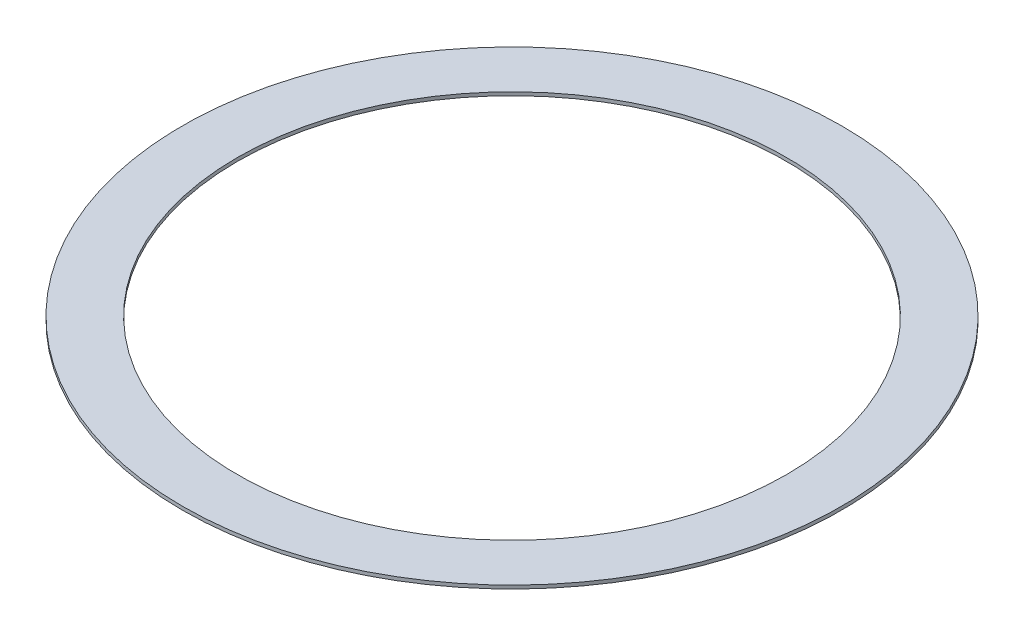
ISO-10303-21;
HEADER;
FILE_DESCRIPTION(('STEP AP214'),'2;1');
FILE_NAME('part.step','',(''),(''),'','','');
FILE_SCHEMA(('AUTOMOTIVE_DESIGN { 1 0 10303 214 1 1 1 1 }'));
ENDSEC;
DATA;
#1=APPLICATION_CONTEXT('core data for automotive mechanical design processes');
#2=APPLICATION_PROTOCOL_DEFINITION('international standard','automotive_design',2000,#1);
#3=PRODUCT_CONTEXT('',#1,'mechanical');
#4=PRODUCT('Part','Part','',(#3));
#5=PRODUCT_RELATED_PRODUCT_CATEGORY('part','',(#4));
#6=PRODUCT_DEFINITION_FORMATION('','',#4);
#7=PRODUCT_DEFINITION_CONTEXT('part definition',#1,'design');
#8=PRODUCT_DEFINITION('design','',#6,#7);
#9=PRODUCT_DEFINITION_SHAPE('','',#8);
#10=(LENGTH_UNIT() NAMED_UNIT(*) SI_UNIT(.MILLI.,.METRE.));
#11=(NAMED_UNIT(*) PLANE_ANGLE_UNIT() SI_UNIT($,.RADIAN.));
#12=(NAMED_UNIT(*) SI_UNIT($,.STERADIAN.) SOLID_ANGLE_UNIT());
#13=UNCERTAINTY_MEASURE_WITH_UNIT(LENGTH_MEASURE(1.E-05),#10,'distance_accuracy_value','');
#14=(GEOMETRIC_REPRESENTATION_CONTEXT(3) GLOBAL_UNCERTAINTY_ASSIGNED_CONTEXT((#13)) GLOBAL_UNIT_ASSIGNED_CONTEXT((#10,
#11,#12)) REPRESENTATION_CONTEXT('',''));
#15=CARTESIAN_POINT('',(0.,0.,0.));
#16=DIRECTION('',(0.,0.,1.));
#17=DIRECTION('',(1.,0.,0.));
#18=AXIS2_PLACEMENT_3D('',#15,#16,#17);
#19=CARTESIAN_POINT('',(0.,0.5,0.));
#20=DIRECTION('',(0.,1.,0.));
#21=DIRECTION('',(0.,0.,1.));
#22=AXIS2_PLACEMENT_3D('',#19,#20,#21);
#23=PLANE('',#22);
#24=CARTESIAN_POINT('',(0.,0.5,0.));
#25=DIRECTION('',(0.,1.,0.));
#26=DIRECTION('',(0.,0.,1.));
#27=AXIS2_PLACEMENT_3D('',#24,#25,#26);
#28=CIRCLE('',#27,48.);
#29=CARTESIAN_POINT('',(0.,0.5,48.));
#30=VERTEX_POINT('',#29);
#31=EDGE_CURVE('E11',#30,#30,#28,.T.);
#32=ORIENTED_EDGE('',*,*,#31,.T.);
#33=EDGE_LOOP('',(#32));
#34=FACE_BOUND('',#33,.T.);
#35=CARTESIAN_POINT('',(0.,0.5,0.));
#36=DIRECTION('',(0.,1.,0.));
#37=DIRECTION('',(1.,0.,0.));
#38=AXIS2_PLACEMENT_3D('',#35,#36,#37);
#39=CIRCLE('',#38,40.);
#40=CARTESIAN_POINT('',(40.,0.5,0.));
#41=VERTEX_POINT('',#40);
#42=EDGE_CURVE('E49',#41,#41,#39,.T.);
#43=ORIENTED_EDGE('',*,*,#42,.F.);
#44=EDGE_LOOP('',(#43));
#45=FACE_BOUND('',#44,.T.);
#46=ADVANCED_FACE('F38',(#34,#45),#23,.T.);
#47=CARTESIAN_POINT('',(0.,0.,0.));
#48=DIRECTION('',(0.,1.,0.));
#49=DIRECTION('',(0.,0.,1.));
#50=AXIS2_PLACEMENT_3D('',#47,#48,#49);
#51=PLANE('',#50);
#52=CARTESIAN_POINT('',(0.,0.,0.));
#53=DIRECTION('',(0.,1.,0.));
#54=DIRECTION('',(0.,0.,1.));
#55=AXIS2_PLACEMENT_3D('',#52,#53,#54);
#56=CIRCLE('',#55,48.);
#57=CARTESIAN_POINT('',(0.,0.,48.));
#58=VERTEX_POINT('',#57);
#59=EDGE_CURVE('E42',#58,#58,#56,.T.);
#60=ORIENTED_EDGE('',*,*,#59,.F.);
#61=EDGE_LOOP('',(#60));
#62=FACE_BOUND('',#61,.T.);
#63=CARTESIAN_POINT('',(0.,0.,0.));
#64=DIRECTION('',(0.,1.,0.));
#65=DIRECTION('',(1.,0.,0.));
#66=AXIS2_PLACEMENT_3D('',#63,#64,#65);
#67=CIRCLE('',#66,40.);
#68=CARTESIAN_POINT('',(40.,0.,0.));
#69=VERTEX_POINT('',#68);
#70=EDGE_CURVE('E51',#69,#69,#67,.T.);
#71=ORIENTED_EDGE('',*,*,#70,.T.);
#72=EDGE_LOOP('',(#71));
#73=FACE_BOUND('',#72,.T.);
#74=ADVANCED_FACE('F61',(#62,#73),#51,.F.);
#75=CARTESIAN_POINT('',(0.,0.5,0.));
#76=DIRECTION('',(0.,-1.,0.));
#77=DIRECTION('',(0.,0.,-1.));
#78=AXIS2_PLACEMENT_3D('',#75,#76,#77);
#79=CYLINDRICAL_SURFACE('',#78,48.);
#80=ORIENTED_EDGE('',*,*,#31,.F.);
#81=EDGE_LOOP('',(#80));
#82=FACE_BOUND('',#81,.T.);
#83=ORIENTED_EDGE('',*,*,#59,.T.);
#84=EDGE_LOOP('',(#83));
#85=FACE_BOUND('',#84,.T.);
#86=ADVANCED_FACE('F40',(#82,#85),#79,.T.);
#87=CARTESIAN_POINT('',(0.,0.5,0.));
#88=DIRECTION('',(0.,-1.,0.));
#89=DIRECTION('',(0.,0.,-1.));
#90=AXIS2_PLACEMENT_3D('',#87,#88,#89);
#91=CYLINDRICAL_SURFACE('',#90,40.);
#92=ORIENTED_EDGE('',*,*,#42,.T.);
#93=EDGE_LOOP('',(#92));
#94=FACE_BOUND('',#93,.T.);
#95=ORIENTED_EDGE('',*,*,#70,.F.);
#96=EDGE_LOOP('',(#95));
#97=FACE_BOUND('',#96,.T.);
#98=ADVANCED_FACE('F57',(#94,#97),#91,.F.);
#99=CLOSED_SHELL('',(#46,#74,#86,#98));
#100=MANIFOLD_SOLID_BREP('B2',#99);
#101=ADVANCED_BREP_SHAPE_REPRESENTATION('',(#18,#100),#14);
#102=SHAPE_DEFINITION_REPRESENTATION(#9,#101);
ENDSEC;
END-ISO-10303-21;
